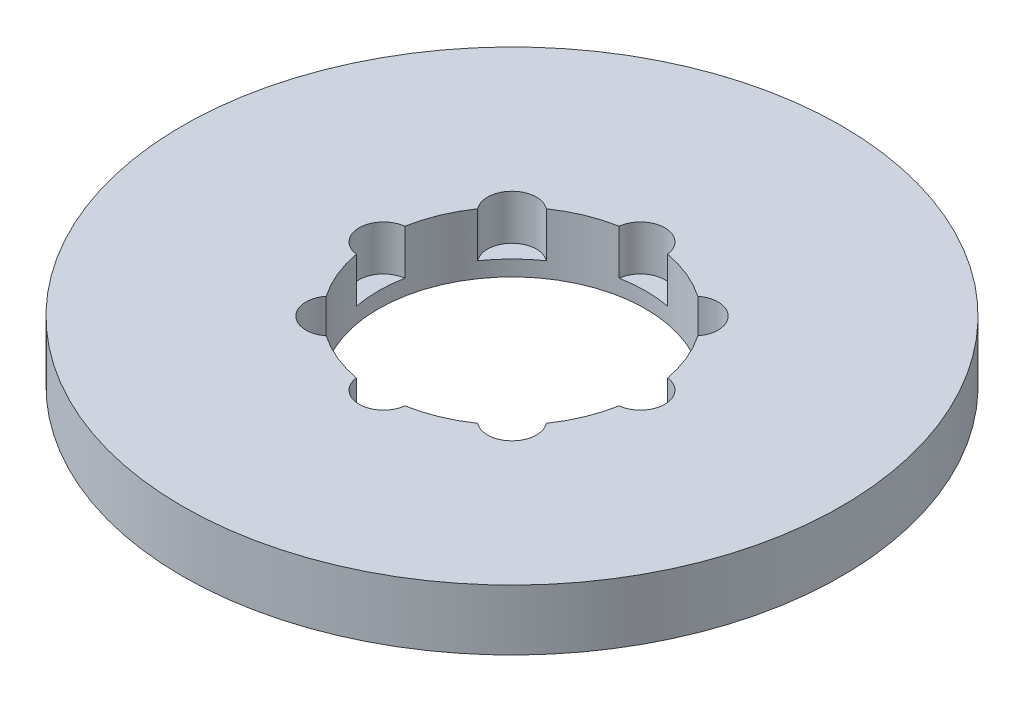
ISO-10303-21;
HEADER;
FILE_DESCRIPTION(('STEP AP214'),'2;1');
FILE_NAME('part.step','',(''),(''),'','','');
FILE_SCHEMA(('AUTOMOTIVE_DESIGN { 1 0 10303 214 1 1 1 1 }'));
ENDSEC;
DATA;
#1=APPLICATION_CONTEXT('core data for automotive mechanical design processes');
#2=APPLICATION_PROTOCOL_DEFINITION('international standard','automotive_design',2000,#1);
#3=PRODUCT_CONTEXT('',#1,'mechanical');
#4=PRODUCT('Part','Part','',(#3));
#5=PRODUCT_RELATED_PRODUCT_CATEGORY('part','',(#4));
#6=PRODUCT_DEFINITION_FORMATION('','',#4);
#7=PRODUCT_DEFINITION_CONTEXT('part definition',#1,'design');
#8=PRODUCT_DEFINITION('design','',#6,#7);
#9=PRODUCT_DEFINITION_SHAPE('','',#8);
#10=(LENGTH_UNIT() NAMED_UNIT(*) SI_UNIT(.MILLI.,.METRE.));
#11=(NAMED_UNIT(*) PLANE_ANGLE_UNIT() SI_UNIT($,.RADIAN.));
#12=(NAMED_UNIT(*) SI_UNIT($,.STERADIAN.) SOLID_ANGLE_UNIT());
#13=UNCERTAINTY_MEASURE_WITH_UNIT(LENGTH_MEASURE(1.E-05),#10,'distance_accuracy_value','');
#14=(GEOMETRIC_REPRESENTATION_CONTEXT(3) GLOBAL_UNCERTAINTY_ASSIGNED_CONTEXT((#13)) GLOBAL_UNIT_ASSIGNED_CONTEXT((#10,
#11,#12)) REPRESENTATION_CONTEXT('',''));
#15=CARTESIAN_POINT('',(0.,0.,0.));
#16=DIRECTION('',(0.,0.,1.));
#17=DIRECTION('',(1.,0.,0.));
#18=AXIS2_PLACEMENT_3D('',#15,#16,#17);
#19=CARTESIAN_POINT('',(0.,17.,0.));
#20=DIRECTION('',(0.,-1.,0.));
#21=DIRECTION('',(0.,0.,-1.));
#22=AXIS2_PLACEMENT_3D('',#19,#20,#21);
#23=CYLINDRICAL_SURFACE('',#22,92.5);
#24=CARTESIAN_POINT('',(0.,17.,0.));
#25=DIRECTION('',(0.,1.,0.));
#26=DIRECTION('',(0.,0.,1.));
#27=AXIS2_PLACEMENT_3D('',#24,#25,#26);
#28=CIRCLE('',#27,92.5);
#29=CARTESIAN_POINT('',(0.,17.,92.5));
#30=VERTEX_POINT('',#29);
#31=EDGE_CURVE('E183',#30,#30,#28,.T.);
#32=ORIENTED_EDGE('',*,*,#31,.F.);
#33=EDGE_LOOP('',(#32));
#34=FACE_BOUND('',#33,.T.);
#35=CARTESIAN_POINT('',(0.,0.,0.));
#36=DIRECTION('',(0.,1.,0.));
#37=DIRECTION('',(0.,0.,1.));
#38=AXIS2_PLACEMENT_3D('',#35,#36,#37);
#39=CIRCLE('',#38,92.5);
#40=CARTESIAN_POINT('',(0.,0.,92.5));
#41=VERTEX_POINT('',#40);
#42=EDGE_CURVE('E182',#41,#41,#39,.T.);
#43=ORIENTED_EDGE('',*,*,#42,.T.);
#44=EDGE_LOOP('',(#43));
#45=FACE_BOUND('',#44,.T.);
#46=ADVANCED_FACE('F39',(#34,#45),#23,.T.);
#47=CARTESIAN_POINT('',(0.,17.,0.));
#48=DIRECTION('',(0.,1.,0.));
#49=DIRECTION('',(0.,0.,1.));
#50=AXIS2_PLACEMENT_3D('',#47,#48,#49);
#51=PLANE('',#50);
#52=CARTESIAN_POINT('',(1.25866394153644E-13,17.,36.049568059656));
#53=DIRECTION('',(0.,1.,0.));
#54=DIRECTION('',(1.,0.,0.));
#55=AXIS2_PLACEMENT_3D('',#52,#53,#54);
#56=CIRCLE('',#55,6.85611529059892);
#57=CARTESIAN_POINT('',(-6.80597710764489,17.,36.8772107894593));
#58=VERTEX_POINT('',#57);
#59=CARTESIAN_POINT('',(6.80597710764514,17.,36.8772107894593));
#60=VERTEX_POINT('',#59);
#61=EDGE_CURVE('E256',#58,#60,#56,.T.);
#62=ORIENTED_EDGE('',*,*,#61,.F.);
#63=CARTESIAN_POINT('',(0.,17.,0.));
#64=DIRECTION('',(0.,1.,0.));
#65=DIRECTION('',(0.,0.,1.));
#66=AXIS2_PLACEMENT_3D('',#63,#64,#65);
#67=CIRCLE('',#66,37.5);
#68=CARTESIAN_POINT('',(-21.2635732550561,17.,30.8886783858886));
#69=VERTEX_POINT('',#68);
#70=EDGE_CURVE('E175',#69,#58,#67,.T.);
#71=ORIENTED_EDGE('',*,*,#70,.F.);
#72=CARTESIAN_POINT('',(-25.4908940338287,17.,25.4908940338287));
#73=DIRECTION('',(0.,1.,0.));
#74=DIRECTION('',(0.707106781186549,0.,0.707106781186546));
#75=AXIS2_PLACEMENT_3D('',#72,#73,#74);
#76=CIRCLE('',#75,6.85611529059892);
#77=CARTESIAN_POINT('',(-30.8886783858885,17.,21.2635732550562));
#78=VERTEX_POINT('',#77);
#79=EDGE_CURVE('E152',#78,#69,#76,.T.);
#80=ORIENTED_EDGE('',*,*,#79,.F.);
#81=CARTESIAN_POINT('',(-36.8772107894593,17.,6.80597710764502));
#82=VERTEX_POINT('',#81);
#83=EDGE_CURVE('E168',#82,#78,#67,.T.);
#84=ORIENTED_EDGE('',*,*,#83,.F.);
#85=CARTESIAN_POINT('',(-36.049568059656,17.,0.));
#86=DIRECTION('',(0.,1.,0.));
#87=DIRECTION('',(0.,0.,1.));
#88=AXIS2_PLACEMENT_3D('',#85,#86,#87);
#89=CIRCLE('',#88,6.85611529059892);
#90=CARTESIAN_POINT('',(-36.8772107894593,17.,-6.80597710764502));
#91=VERTEX_POINT('',#90);
#92=EDGE_CURVE('E205',#91,#82,#89,.T.);
#93=ORIENTED_EDGE('',*,*,#92,.F.);
#94=CARTESIAN_POINT('',(-30.8886783858888,17.,-21.2635732550558));
#95=VERTEX_POINT('',#94);
#96=EDGE_CURVE('E181',#95,#91,#67,.T.);
#97=ORIENTED_EDGE('',*,*,#96,.F.);
#98=CARTESIAN_POINT('',(-25.490894033829,17.,-25.4908940338284));
#99=DIRECTION('',(0.,1.,0.));
#100=DIRECTION('',(-0.707106781186539,0.,0.707106781186556));
#101=AXIS2_PLACEMENT_3D('',#98,#99,#100);
#102=CIRCLE('',#101,6.85611529059892);
#103=CARTESIAN_POINT('',(-21.2635732550566,17.,-30.8886783858883));
#104=VERTEX_POINT('',#103);
#105=EDGE_CURVE('E453',#104,#95,#102,.T.);
#106=ORIENTED_EDGE('',*,*,#105,.F.);
#107=CARTESIAN_POINT('',(-6.8059771076454,17.,-36.8772107894592));
#108=VERTEX_POINT('',#107);
#109=EDGE_CURVE('E189',#108,#104,#67,.T.);
#110=ORIENTED_EDGE('',*,*,#109,.F.);
#111=CARTESIAN_POINT('',(-3.77599182460933E-13,17.,-36.049568059656));
#112=DIRECTION('',(0.,1.,0.));
#113=DIRECTION('',(-1.,0.,0.));
#114=AXIS2_PLACEMENT_3D('',#111,#112,#113);
#115=CIRCLE('',#114,6.85611529059892);
#116=CARTESIAN_POINT('',(6.80597710764463,17.,-36.8772107894594));
#117=VERTEX_POINT('',#116);
#118=EDGE_CURVE('E462',#117,#108,#115,.T.);
#119=ORIENTED_EDGE('',*,*,#118,.F.);
#120=CARTESIAN_POINT('',(21.2635732550559,17.,-30.8886783858888));
#121=VERTEX_POINT('',#120);
#122=EDGE_CURVE('E197',#121,#117,#67,.T.);
#123=ORIENTED_EDGE('',*,*,#122,.F.);
#124=CARTESIAN_POINT('',(25.4908940338285,17.,-25.4908940338289));
#125=DIRECTION('',(0.,1.,0.));
#126=DIRECTION('',(-0.707106781186554,0.,-0.707106781186541));
#127=AXIS2_PLACEMENT_3D('',#124,#125,#126);
#128=CIRCLE('',#127,6.85611529059892);
#129=CARTESIAN_POINT('',(30.8886783858884,17.,-21.2635732550564));
#130=VERTEX_POINT('',#129);
#131=EDGE_CURVE('E470',#130,#121,#128,.T.);
#132=ORIENTED_EDGE('',*,*,#131,.F.);
#133=CARTESIAN_POINT('',(36.8772107894593,17.,-6.80597710764502));
#134=VERTEX_POINT('',#133);
#135=EDGE_CURVE('E489',#134,#130,#67,.T.);
#136=ORIENTED_EDGE('',*,*,#135,.F.);
#137=CARTESIAN_POINT('',(36.049568059656,17.,0.));
#138=DIRECTION('',(0.,1.,0.));
#139=DIRECTION('',(0.,0.,-1.));
#140=AXIS2_PLACEMENT_3D('',#137,#138,#139);
#141=CIRCLE('',#140,6.85611529059892);
#142=CARTESIAN_POINT('',(36.8772107894593,17.,6.80597710764502));
#143=VERTEX_POINT('',#142);
#144=EDGE_CURVE('E476',#143,#134,#141,.T.);
#145=ORIENTED_EDGE('',*,*,#144,.F.);
#146=CARTESIAN_POINT('',(30.8886783858887,17.,21.263573255056));
#147=VERTEX_POINT('',#146);
#148=EDGE_CURVE('E491',#147,#143,#67,.T.);
#149=ORIENTED_EDGE('',*,*,#148,.F.);
#150=CARTESIAN_POINT('',(25.4908940338288,17.,25.4908940338286));
#151=DIRECTION('',(0.,1.,0.));
#152=DIRECTION('',(0.707106781186544,0.,-0.707106781186551));
#153=AXIS2_PLACEMENT_3D('',#150,#151,#152);
#154=CIRCLE('',#153,6.85611529059892);
#155=CARTESIAN_POINT('',(21.2635732550563,17.,30.8886783858885));
#156=VERTEX_POINT('',#155);
#157=EDGE_CURVE('E475',#156,#147,#154,.T.);
#158=ORIENTED_EDGE('',*,*,#157,.F.);
#159=EDGE_CURVE('E190',#60,#156,#67,.T.);
#160=ORIENTED_EDGE('',*,*,#159,.F.);
#161=EDGE_LOOP('',(#62,#71,#80,#84,#93,#97,#106,#110,#119,#123,#132,#136,#145,#149,#158,#160));
#162=FACE_BOUND('',#161,.T.);
#163=ORIENTED_EDGE('',*,*,#31,.T.);
#164=EDGE_LOOP('',(#163));
#165=FACE_BOUND('',#164,.T.);
#166=ADVANCED_FACE('F170',(#162,#165),#51,.T.);
#167=CARTESIAN_POINT('',(0.,0.,0.));
#168=DIRECTION('',(0.,1.,0.));
#169=DIRECTION('',(0.,0.,1.));
#170=AXIS2_PLACEMENT_3D('',#167,#168,#169);
#171=PLANE('',#170);
#172=CARTESIAN_POINT('',(0.,0.,0.));
#173=DIRECTION('',(0.,1.,0.));
#174=DIRECTION('',(0.,0.,1.));
#175=AXIS2_PLACEMENT_3D('',#172,#173,#174);
#176=CIRCLE('',#175,37.5);
#177=CARTESIAN_POINT('',(0.,0.,37.5));
#178=VERTEX_POINT('',#177);
#179=EDGE_CURVE('E191',#178,#178,#176,.T.);
#180=ORIENTED_EDGE('',*,*,#179,.T.);
#181=EDGE_LOOP('',(#180));
#182=FACE_BOUND('',#181,.T.);
#183=ORIENTED_EDGE('',*,*,#42,.F.);
#184=EDGE_LOOP('',(#183));
#185=FACE_BOUND('',#184,.T.);
#186=ADVANCED_FACE('F277',(#182,#185),#171,.F.);
#187=CARTESIAN_POINT('',(0.,17.,0.));
#188=DIRECTION('',(0.,-1.,0.));
#189=DIRECTION('',(0.,0.,-1.));
#190=AXIS2_PLACEMENT_3D('',#187,#188,#189);
#191=CYLINDRICAL_SURFACE('',#190,37.5);
#192=DIRECTION('',(0.,1.,0.));
#193=VECTOR('',#192,1.);
#194=CARTESIAN_POINT('',(-6.80597710764489,10.6784272384708,36.8772107894593));
#195=LINE('',#194,#193);
#196=CARTESIAN_POINT('',(-6.80597710764489,4.35685447694161,36.8772107894593));
#197=VERTEX_POINT('',#196);
#198=EDGE_CURVE('E11',#197,#58,#195,.T.);
#199=ORIENTED_EDGE('',*,*,#198,.F.);
#200=CARTESIAN_POINT('',(0.,4.35685447694161,0.));
#201=DIRECTION('',(0.,1.,0.));
#202=DIRECTION('',(0.,0.,1.));
#203=AXIS2_PLACEMENT_3D('',#200,#201,#202);
#204=CIRCLE('',#203,37.5);
#205=CARTESIAN_POINT('',(6.80597710764514,4.35685447694161,36.8772107894593));
#206=VERTEX_POINT('',#205);
#207=EDGE_CURVE('E251',#197,#206,#204,.T.);
#208=ORIENTED_EDGE('',*,*,#207,.T.);
#209=DIRECTION('',(0.,1.,0.));
#210=VECTOR('',#209,1.);
#211=CARTESIAN_POINT('',(6.80597710764514,10.6784272384708,36.8772107894593));
#212=LINE('',#211,#210);
#213=EDGE_CURVE('E46',#60,#206,#212,.F.);
#214=ORIENTED_EDGE('',*,*,#213,.F.);
#215=ORIENTED_EDGE('',*,*,#159,.T.);
#216=DIRECTION('',(0.,1.,0.));
#217=VECTOR('',#216,1.);
#218=CARTESIAN_POINT('',(21.2635732550563,10.6784272384708,30.8886783858885));
#219=LINE('',#218,#217);
#220=CARTESIAN_POINT('',(21.2635732550563,4.35685447694161,30.8886783858885));
#221=VERTEX_POINT('',#220);
#222=EDGE_CURVE('E253',#221,#156,#219,.T.);
#223=ORIENTED_EDGE('',*,*,#222,.F.);
#224=CARTESIAN_POINT('',(0.,4.35685447694161,0.));
#225=DIRECTION('',(0.,1.,0.));
#226=DIRECTION('',(0.,0.,1.));
#227=AXIS2_PLACEMENT_3D('',#224,#225,#226);
#228=CIRCLE('',#227,37.5);
#229=CARTESIAN_POINT('',(30.8886783858887,4.35685447694161,21.263573255056));
#230=VERTEX_POINT('',#229);
#231=EDGE_CURVE('E246',#221,#230,#228,.T.);
#232=ORIENTED_EDGE('',*,*,#231,.T.);
#233=DIRECTION('',(0.,1.,0.));
#234=VECTOR('',#233,1.);
#235=CARTESIAN_POINT('',(30.8886783858887,10.6784272384708,21.263573255056));
#236=LINE('',#235,#234);
#237=EDGE_CURVE('E248',#147,#230,#236,.F.);
#238=ORIENTED_EDGE('',*,*,#237,.F.);
#239=ORIENTED_EDGE('',*,*,#148,.T.);
#240=DIRECTION('',(0.,1.,0.));
#241=VECTOR('',#240,1.);
#242=CARTESIAN_POINT('',(36.8772107894593,10.6784272384708,6.80597710764502));
#243=LINE('',#242,#241);
#244=CARTESIAN_POINT('',(36.8772107894593,4.35685447694161,6.80597710764502));
#245=VERTEX_POINT('',#244);
#246=EDGE_CURVE('E243',#245,#143,#243,.T.);
#247=ORIENTED_EDGE('',*,*,#246,.F.);
#248=CARTESIAN_POINT('',(0.,4.35685447694161,0.));
#249=DIRECTION('',(0.,1.,0.));
#250=DIRECTION('',(0.,0.,1.));
#251=AXIS2_PLACEMENT_3D('',#248,#249,#250);
#252=CIRCLE('',#251,37.5);
#253=CARTESIAN_POINT('',(36.8772107894593,4.35685447694161,-6.80597710764502));
#254=VERTEX_POINT('',#253);
#255=EDGE_CURVE('E236',#245,#254,#252,.T.);
#256=ORIENTED_EDGE('',*,*,#255,.T.);
#257=DIRECTION('',(0.,1.,0.));
#258=VECTOR('',#257,1.);
#259=CARTESIAN_POINT('',(36.8772107894593,10.6784272384708,-6.80597710764502));
#260=LINE('',#259,#258);
#261=EDGE_CURVE('E241',#134,#254,#260,.F.);
#262=ORIENTED_EDGE('',*,*,#261,.F.);
#263=ORIENTED_EDGE('',*,*,#135,.T.);
#264=DIRECTION('',(0.,1.,0.));
#265=VECTOR('',#264,1.);
#266=CARTESIAN_POINT('',(30.8886783858884,10.6784272384708,-21.2635732550564));
#267=LINE('',#266,#265);
#268=CARTESIAN_POINT('',(30.8886783858884,4.35685447694161,-21.2635732550564));
#269=VERTEX_POINT('',#268);
#270=EDGE_CURVE('E237',#269,#130,#267,.T.);
#271=ORIENTED_EDGE('',*,*,#270,.F.);
#272=CARTESIAN_POINT('',(0.,4.35685447694161,0.));
#273=DIRECTION('',(0.,1.,0.));
#274=DIRECTION('',(0.,0.,1.));
#275=AXIS2_PLACEMENT_3D('',#272,#273,#274);
#276=CIRCLE('',#275,37.5);
#277=CARTESIAN_POINT('',(21.2635732550559,4.35685447694161,-30.8886783858888));
#278=VERTEX_POINT('',#277);
#279=EDGE_CURVE('E229',#269,#278,#276,.T.);
#280=ORIENTED_EDGE('',*,*,#279,.T.);
#281=DIRECTION('',(0.,1.,0.));
#282=VECTOR('',#281,1.);
#283=CARTESIAN_POINT('',(21.2635732550559,10.6784272384708,-30.8886783858888));
#284=LINE('',#283,#282);
#285=EDGE_CURVE('E232',#121,#278,#284,.F.);
#286=ORIENTED_EDGE('',*,*,#285,.F.);
#287=ORIENTED_EDGE('',*,*,#122,.T.);
#288=DIRECTION('',(0.,1.,0.));
#289=VECTOR('',#288,1.);
#290=CARTESIAN_POINT('',(6.80597710764463,10.6784272384708,-36.8772107894594));
#291=LINE('',#290,#289);
#292=CARTESIAN_POINT('',(6.80597710764463,4.35685447694161,-36.8772107894594));
#293=VERTEX_POINT('',#292);
#294=EDGE_CURVE('E227',#293,#117,#291,.T.);
#295=ORIENTED_EDGE('',*,*,#294,.F.);
#296=CARTESIAN_POINT('',(0.,4.35685447694161,0.));
#297=DIRECTION('',(0.,1.,0.));
#298=DIRECTION('',(0.,0.,1.));
#299=AXIS2_PLACEMENT_3D('',#296,#297,#298);
#300=CIRCLE('',#299,37.5);
#301=CARTESIAN_POINT('',(-6.8059771076454,4.35685447694161,-36.8772107894592));
#302=VERTEX_POINT('',#301);
#303=EDGE_CURVE('E225',#293,#302,#300,.T.);
#304=ORIENTED_EDGE('',*,*,#303,.T.);
#305=DIRECTION('',(0.,1.,0.));
#306=VECTOR('',#305,1.);
#307=CARTESIAN_POINT('',(-6.8059771076454,10.6784272384708,-36.8772107894592));
#308=LINE('',#307,#306);
#309=EDGE_CURVE('E223',#108,#302,#308,.F.);
#310=ORIENTED_EDGE('',*,*,#309,.F.);
#311=ORIENTED_EDGE('',*,*,#109,.T.);
#312=DIRECTION('',(0.,1.,0.));
#313=VECTOR('',#312,1.);
#314=CARTESIAN_POINT('',(-21.2635732550566,10.6784272384708,-30.8886783858883));
#315=LINE('',#314,#313);
#316=CARTESIAN_POINT('',(-21.2635732550566,4.35685447694161,-30.8886783858883));
#317=VERTEX_POINT('',#316);
#318=EDGE_CURVE('E219',#317,#104,#315,.T.);
#319=ORIENTED_EDGE('',*,*,#318,.F.);
#320=CARTESIAN_POINT('',(0.,4.35685447694161,0.));
#321=DIRECTION('',(0.,1.,0.));
#322=DIRECTION('',(0.,0.,1.));
#323=AXIS2_PLACEMENT_3D('',#320,#321,#322);
#324=CIRCLE('',#323,37.5);
#325=CARTESIAN_POINT('',(-30.8886783858888,4.35685447694161,-21.2635732550558));
#326=VERTEX_POINT('',#325);
#327=EDGE_CURVE('E159',#317,#326,#324,.T.);
#328=ORIENTED_EDGE('',*,*,#327,.T.);
#329=DIRECTION('',(0.,1.,0.));
#330=VECTOR('',#329,1.);
#331=CARTESIAN_POINT('',(-30.8886783858888,10.6784272384708,-21.2635732550558));
#332=LINE('',#331,#330);
#333=EDGE_CURVE('E220',#95,#326,#332,.F.);
#334=ORIENTED_EDGE('',*,*,#333,.F.);
#335=ORIENTED_EDGE('',*,*,#96,.T.);
#336=DIRECTION('',(0.,1.,0.));
#337=VECTOR('',#336,1.);
#338=CARTESIAN_POINT('',(-36.8772107894593,10.6784272384708,-6.80597710764502));
#339=LINE('',#338,#337);
#340=CARTESIAN_POINT('',(-36.8772107894593,4.35685447694161,-6.80597710764502));
#341=VERTEX_POINT('',#340);
#342=EDGE_CURVE('E209',#341,#91,#339,.T.);
#343=ORIENTED_EDGE('',*,*,#342,.F.);
#344=CARTESIAN_POINT('',(0.,4.35685447694161,0.));
#345=DIRECTION('',(0.,1.,0.));
#346=DIRECTION('',(0.,0.,1.));
#347=AXIS2_PLACEMENT_3D('',#344,#345,#346);
#348=CIRCLE('',#347,37.5);
#349=CARTESIAN_POINT('',(-36.8772107894593,4.35685447694161,6.80597710764502));
#350=VERTEX_POINT('',#349);
#351=EDGE_CURVE('E206',#341,#350,#348,.T.);
#352=ORIENTED_EDGE('',*,*,#351,.T.);
#353=DIRECTION('',(0.,1.,0.));
#354=VECTOR('',#353,1.);
#355=CARTESIAN_POINT('',(-36.8772107894593,10.6784272384708,6.80597710764502));
#356=LINE('',#355,#354);
#357=EDGE_CURVE('E179',#82,#350,#356,.F.);
#358=ORIENTED_EDGE('',*,*,#357,.F.);
#359=ORIENTED_EDGE('',*,*,#83,.T.);
#360=DIRECTION('',(0.,1.,0.));
#361=VECTOR('',#360,1.);
#362=CARTESIAN_POINT('',(-30.8886783858885,10.6784272384708,21.2635732550562));
#363=LINE('',#362,#361);
#364=CARTESIAN_POINT('',(-30.8886783858885,4.35685447694161,21.2635732550562));
#365=VERTEX_POINT('',#364);
#366=EDGE_CURVE('E147',#365,#78,#363,.T.);
#367=ORIENTED_EDGE('',*,*,#366,.F.);
#368=CARTESIAN_POINT('',(0.,4.35685447694161,0.));
#369=DIRECTION('',(0.,1.,0.));
#370=DIRECTION('',(0.,0.,1.));
#371=AXIS2_PLACEMENT_3D('',#368,#369,#370);
#372=CIRCLE('',#371,37.5);
#373=CARTESIAN_POINT('',(-21.2635732550561,4.35685447694161,30.8886783858886));
#374=VERTEX_POINT('',#373);
#375=EDGE_CURVE('E215',#365,#374,#372,.T.);
#376=ORIENTED_EDGE('',*,*,#375,.T.);
#377=DIRECTION('',(0.,1.,0.));
#378=VECTOR('',#377,1.);
#379=CARTESIAN_POINT('',(-21.2635732550561,10.6784272384708,30.8886783858886));
#380=LINE('',#379,#378);
#381=EDGE_CURVE('E161',#69,#374,#380,.F.);
#382=ORIENTED_EDGE('',*,*,#381,.F.);
#383=ORIENTED_EDGE('',*,*,#70,.T.);
#384=EDGE_LOOP('',(#199,#208,#214,#215,#223,#232,#238,#239,#247,#256,#262,#263,#271,#280,#286,
#287,#295,#304,#310,#311,#319,#328,#334,#335,#343,#352,#358,#359,#367,#376,#382,#383));
#385=FACE_BOUND('',#384,.T.);
#386=ORIENTED_EDGE('',*,*,#179,.F.);
#387=EDGE_LOOP('',(#386));
#388=FACE_BOUND('',#387,.T.);
#389=ADVANCED_FACE('F176',(#385,#388),#191,.F.);
#390=CARTESIAN_POINT('',(-36.049568059656,4.35685447694161,0.));
#391=DIRECTION('',(0.,1.,0.));
#392=DIRECTION('',(0.,0.,1.));
#393=AXIS2_PLACEMENT_3D('',#390,#391,#392);
#394=CYLINDRICAL_SURFACE('',#393,6.85611529059892);
#395=ORIENTED_EDGE('',*,*,#342,.T.);
#396=ORIENTED_EDGE('',*,*,#92,.T.);
#397=ORIENTED_EDGE('',*,*,#357,.T.);
#398=CARTESIAN_POINT('',(-36.049568059656,4.35685447694161,0.));
#399=DIRECTION('',(0.,1.,0.));
#400=DIRECTION('',(0.,0.,1.));
#401=AXIS2_PLACEMENT_3D('',#398,#399,#400);
#402=CIRCLE('',#401,6.85611529059892);
#403=EDGE_CURVE('E200',#341,#350,#402,.T.);
#404=ORIENTED_EDGE('',*,*,#403,.F.);
#405=EDGE_LOOP('',(#395,#396,#397,#404));
#406=FACE_BOUND('',#405,.T.);
#407=ADVANCED_FACE('F286',(#406),#394,.F.);
#408=CARTESIAN_POINT('',(-36.049568059656,4.35685447694161,0.));
#409=DIRECTION('',(0.,1.,0.));
#410=DIRECTION('',(0.,0.,1.));
#411=AXIS2_PLACEMENT_3D('',#408,#409,#410);
#412=PLANE('',#411);
#413=ORIENTED_EDGE('',*,*,#403,.T.);
#414=ORIENTED_EDGE('',*,*,#351,.F.);
#415=EDGE_LOOP('',(#413,#414));
#416=FACE_BOUND('',#415,.T.);
#417=ADVANCED_FACE('F289',(#416),#412,.T.);
#418=CARTESIAN_POINT('',(-25.4908940338287,4.35685447694161,25.4908940338287));
#419=DIRECTION('',(0.,1.,0.));
#420=DIRECTION('',(0.,0.,1.));
#421=AXIS2_PLACEMENT_3D('',#418,#419,#420);
#422=CYLINDRICAL_SURFACE('',#421,6.85611529059892);
#423=ORIENTED_EDGE('',*,*,#366,.T.);
#424=ORIENTED_EDGE('',*,*,#79,.T.);
#425=ORIENTED_EDGE('',*,*,#381,.T.);
#426=CARTESIAN_POINT('',(-25.4908940338287,4.35685447694161,25.4908940338287));
#427=DIRECTION('',(0.,1.,0.));
#428=DIRECTION('',(0.707106781186549,0.,0.707106781186546));
#429=AXIS2_PLACEMENT_3D('',#426,#427,#428);
#430=CIRCLE('',#429,6.85611529059892);
#431=EDGE_CURVE('E156',#365,#374,#430,.T.);
#432=ORIENTED_EDGE('',*,*,#431,.F.);
#433=EDGE_LOOP('',(#423,#424,#425,#432));
#434=FACE_BOUND('',#433,.T.);
#435=ADVANCED_FACE('F155',(#434),#422,.F.);
#436=CARTESIAN_POINT('',(-25.4908940338287,4.35685447694161,25.4908940338287));
#437=DIRECTION('',(0.,1.,0.));
#438=DIRECTION('',(0.707106781186549,0.,0.707106781186546));
#439=AXIS2_PLACEMENT_3D('',#436,#437,#438);
#440=PLANE('',#439);
#441=ORIENTED_EDGE('',*,*,#431,.T.);
#442=ORIENTED_EDGE('',*,*,#375,.F.);
#443=EDGE_LOOP('',(#441,#442));
#444=FACE_BOUND('',#443,.T.);
#445=ADVANCED_FACE('F300',(#444),#440,.T.);
#446=CARTESIAN_POINT('',(-25.490894033829,4.35685447694161,-25.4908940338284));
#447=DIRECTION('',(0.,1.,0.));
#448=DIRECTION('',(0.,0.,1.));
#449=AXIS2_PLACEMENT_3D('',#446,#447,#448);
#450=CYLINDRICAL_SURFACE('',#449,6.85611529059892);
#451=ORIENTED_EDGE('',*,*,#318,.T.);
#452=ORIENTED_EDGE('',*,*,#105,.T.);
#453=ORIENTED_EDGE('',*,*,#333,.T.);
#454=CARTESIAN_POINT('',(-25.490894033829,4.35685447694161,-25.4908940338284));
#455=DIRECTION('',(0.,1.,0.));
#456=DIRECTION('',(-0.707106781186539,0.,0.707106781186556));
#457=AXIS2_PLACEMENT_3D('',#454,#455,#456);
#458=CIRCLE('',#457,6.85611529059892);
#459=EDGE_CURVE('E454',#317,#326,#458,.T.);
#460=ORIENTED_EDGE('',*,*,#459,.F.);
#461=EDGE_LOOP('',(#451,#452,#453,#460));
#462=FACE_BOUND('',#461,.T.);
#463=ADVANCED_FACE('F299',(#462),#450,.F.);
#464=CARTESIAN_POINT('',(-25.490894033829,4.35685447694161,-25.4908940338284));
#465=DIRECTION('',(0.,1.,0.));
#466=DIRECTION('',(-0.707106781186539,0.,0.707106781186556));
#467=AXIS2_PLACEMENT_3D('',#464,#465,#466);
#468=PLANE('',#467);
#469=ORIENTED_EDGE('',*,*,#459,.T.);
#470=ORIENTED_EDGE('',*,*,#327,.F.);
#471=EDGE_LOOP('',(#469,#470));
#472=FACE_BOUND('',#471,.T.);
#473=ADVANCED_FACE('F379',(#472),#468,.T.);
#474=CARTESIAN_POINT('',(-3.77599182460933E-13,4.35685447694161,-36.049568059656));
#475=DIRECTION('',(0.,1.,0.));
#476=DIRECTION('',(0.,0.,1.));
#477=AXIS2_PLACEMENT_3D('',#474,#475,#476);
#478=CYLINDRICAL_SURFACE('',#477,6.85611529059892);
#479=ORIENTED_EDGE('',*,*,#294,.T.);
#480=ORIENTED_EDGE('',*,*,#118,.T.);
#481=ORIENTED_EDGE('',*,*,#309,.T.);
#482=CARTESIAN_POINT('',(-3.77599182460933E-13,4.35685447694161,-36.049568059656));
#483=DIRECTION('',(0.,1.,0.));
#484=DIRECTION('',(-1.,0.,0.));
#485=AXIS2_PLACEMENT_3D('',#482,#483,#484);
#486=CIRCLE('',#485,6.85611529059892);
#487=EDGE_CURVE('E465',#293,#302,#486,.T.);
#488=ORIENTED_EDGE('',*,*,#487,.F.);
#489=EDGE_LOOP('',(#479,#480,#481,#488));
#490=FACE_BOUND('',#489,.T.);
#491=ADVANCED_FACE('F371',(#490),#478,.F.);
#492=CARTESIAN_POINT('',(-3.77599182460933E-13,4.35685447694161,-36.049568059656));
#493=DIRECTION('',(0.,1.,0.));
#494=DIRECTION('',(-1.,0.,0.));
#495=AXIS2_PLACEMENT_3D('',#492,#493,#494);
#496=PLANE('',#495);
#497=ORIENTED_EDGE('',*,*,#487,.T.);
#498=ORIENTED_EDGE('',*,*,#303,.F.);
#499=EDGE_LOOP('',(#497,#498));
#500=FACE_BOUND('',#499,.T.);
#501=ADVANCED_FACE('F308',(#500),#496,.T.);
#502=CARTESIAN_POINT('',(25.4908940338285,4.35685447694161,-25.4908940338289));
#503=DIRECTION('',(0.,1.,0.));
#504=DIRECTION('',(0.,0.,1.));
#505=AXIS2_PLACEMENT_3D('',#502,#503,#504);
#506=CYLINDRICAL_SURFACE('',#505,6.85611529059892);
#507=ORIENTED_EDGE('',*,*,#270,.T.);
#508=ORIENTED_EDGE('',*,*,#131,.T.);
#509=ORIENTED_EDGE('',*,*,#285,.T.);
#510=CARTESIAN_POINT('',(25.4908940338285,4.35685447694161,-25.4908940338289));
#511=DIRECTION('',(0.,1.,0.));
#512=DIRECTION('',(-0.707106781186554,0.,-0.707106781186541));
#513=AXIS2_PLACEMENT_3D('',#510,#511,#512);
#514=CIRCLE('',#513,6.85611529059892);
#515=EDGE_CURVE('E477',#269,#278,#514,.T.);
#516=ORIENTED_EDGE('',*,*,#515,.F.);
#517=EDGE_LOOP('',(#507,#508,#509,#516));
#518=FACE_BOUND('',#517,.T.);
#519=ADVANCED_FACE('F305',(#518),#506,.F.);
#520=CARTESIAN_POINT('',(25.4908940338285,4.35685447694161,-25.4908940338289));
#521=DIRECTION('',(0.,1.,0.));
#522=DIRECTION('',(-0.707106781186554,0.,-0.707106781186541));
#523=AXIS2_PLACEMENT_3D('',#520,#521,#522);
#524=PLANE('',#523);
#525=ORIENTED_EDGE('',*,*,#515,.T.);
#526=ORIENTED_EDGE('',*,*,#279,.F.);
#527=EDGE_LOOP('',(#525,#526));
#528=FACE_BOUND('',#527,.T.);
#529=ADVANCED_FACE('F304',(#528),#524,.T.);
#530=CARTESIAN_POINT('',(36.049568059656,4.35685447694161,0.));
#531=DIRECTION('',(0.,1.,0.));
#532=DIRECTION('',(0.,0.,1.));
#533=AXIS2_PLACEMENT_3D('',#530,#531,#532);
#534=CYLINDRICAL_SURFACE('',#533,6.85611529059892);
#535=ORIENTED_EDGE('',*,*,#246,.T.);
#536=ORIENTED_EDGE('',*,*,#144,.T.);
#537=ORIENTED_EDGE('',*,*,#261,.T.);
#538=CARTESIAN_POINT('',(36.049568059656,4.35685447694161,0.));
#539=DIRECTION('',(0.,1.,0.));
#540=DIRECTION('',(0.,0.,-1.));
#541=AXIS2_PLACEMENT_3D('',#538,#539,#540);
#542=CIRCLE('',#541,6.85611529059892);
#543=EDGE_CURVE('E478',#245,#254,#542,.T.);
#544=ORIENTED_EDGE('',*,*,#543,.F.);
#545=EDGE_LOOP('',(#535,#536,#537,#544));
#546=FACE_BOUND('',#545,.T.);
#547=ADVANCED_FACE('F309',(#546),#534,.F.);
#548=CARTESIAN_POINT('',(36.049568059656,4.35685447694161,0.));
#549=DIRECTION('',(0.,1.,0.));
#550=DIRECTION('',(0.,0.,-1.));
#551=AXIS2_PLACEMENT_3D('',#548,#549,#550);
#552=PLANE('',#551);
#553=ORIENTED_EDGE('',*,*,#543,.T.);
#554=ORIENTED_EDGE('',*,*,#255,.F.);
#555=EDGE_LOOP('',(#553,#554));
#556=FACE_BOUND('',#555,.T.);
#557=ADVANCED_FACE('F314',(#556),#552,.T.);
#558=CARTESIAN_POINT('',(25.4908940338288,4.35685447694161,25.4908940338286));
#559=DIRECTION('',(0.,1.,0.));
#560=DIRECTION('',(0.,0.,1.));
#561=AXIS2_PLACEMENT_3D('',#558,#559,#560);
#562=CYLINDRICAL_SURFACE('',#561,6.85611529059892);
#563=ORIENTED_EDGE('',*,*,#222,.T.);
#564=ORIENTED_EDGE('',*,*,#157,.T.);
#565=ORIENTED_EDGE('',*,*,#237,.T.);
#566=CARTESIAN_POINT('',(25.4908940338288,4.35685447694161,25.4908940338286));
#567=DIRECTION('',(0.,1.,0.));
#568=DIRECTION('',(0.707106781186544,0.,-0.707106781186551));
#569=AXIS2_PLACEMENT_3D('',#566,#567,#568);
#570=CIRCLE('',#569,6.85611529059892);
#571=EDGE_CURVE('E56',#221,#230,#570,.T.);
#572=ORIENTED_EDGE('',*,*,#571,.F.);
#573=EDGE_LOOP('',(#563,#564,#565,#572));
#574=FACE_BOUND('',#573,.T.);
#575=ADVANCED_FACE('F318',(#574),#562,.F.);
#576=CARTESIAN_POINT('',(25.4908940338288,4.35685447694161,25.4908940338286));
#577=DIRECTION('',(0.,1.,0.));
#578=DIRECTION('',(0.707106781186544,0.,-0.707106781186551));
#579=AXIS2_PLACEMENT_3D('',#576,#577,#578);
#580=PLANE('',#579);
#581=ORIENTED_EDGE('',*,*,#571,.T.);
#582=ORIENTED_EDGE('',*,*,#231,.F.);
#583=EDGE_LOOP('',(#581,#582));
#584=FACE_BOUND('',#583,.T.);
#585=ADVANCED_FACE('F270',(#584),#580,.T.);
#586=CARTESIAN_POINT('',(1.25866394153644E-13,4.35685447694161,36.049568059656));
#587=DIRECTION('',(0.,1.,0.));
#588=DIRECTION('',(0.,0.,1.));
#589=AXIS2_PLACEMENT_3D('',#586,#587,#588);
#590=CYLINDRICAL_SURFACE('',#589,6.85611529059892);
#591=ORIENTED_EDGE('',*,*,#198,.T.);
#592=ORIENTED_EDGE('',*,*,#61,.T.);
#593=ORIENTED_EDGE('',*,*,#213,.T.);
#594=CARTESIAN_POINT('',(1.25866394153644E-13,4.35685447694161,36.049568059656));
#595=DIRECTION('',(0.,1.,0.));
#596=DIRECTION('',(1.,0.,0.));
#597=AXIS2_PLACEMENT_3D('',#594,#595,#596);
#598=CIRCLE('',#597,6.85611529059892);
#599=EDGE_CURVE('E55',#197,#206,#598,.T.);
#600=ORIENTED_EDGE('',*,*,#599,.F.);
#601=EDGE_LOOP('',(#591,#592,#593,#600));
#602=FACE_BOUND('',#601,.T.);
#603=ADVANCED_FACE('F260',(#602),#590,.F.);
#604=CARTESIAN_POINT('',(1.25866394153644E-13,4.35685447694161,36.049568059656));
#605=DIRECTION('',(0.,1.,0.));
#606=DIRECTION('',(1.,0.,0.));
#607=AXIS2_PLACEMENT_3D('',#604,#605,#606);
#608=PLANE('',#607);
#609=ORIENTED_EDGE('',*,*,#599,.T.);
#610=ORIENTED_EDGE('',*,*,#207,.F.);
#611=EDGE_LOOP('',(#609,#610));
#612=FACE_BOUND('',#611,.T.);
#613=ADVANCED_FACE('F261',(#612),#608,.T.);
#614=CLOSED_SHELL('',(#46,#166,#186,#389,#407,#417,#435,#445,#463,#473,#491,#501,#519,#529,#547,
#557,#575,#585,#603,#613));
#615=MANIFOLD_SOLID_BREP('B2',#614);
#616=ADVANCED_BREP_SHAPE_REPRESENTATION('',(#18,#615),#14);
#617=SHAPE_DEFINITION_REPRESENTATION(#9,#616);
ENDSEC;
END-ISO-10303-21;
